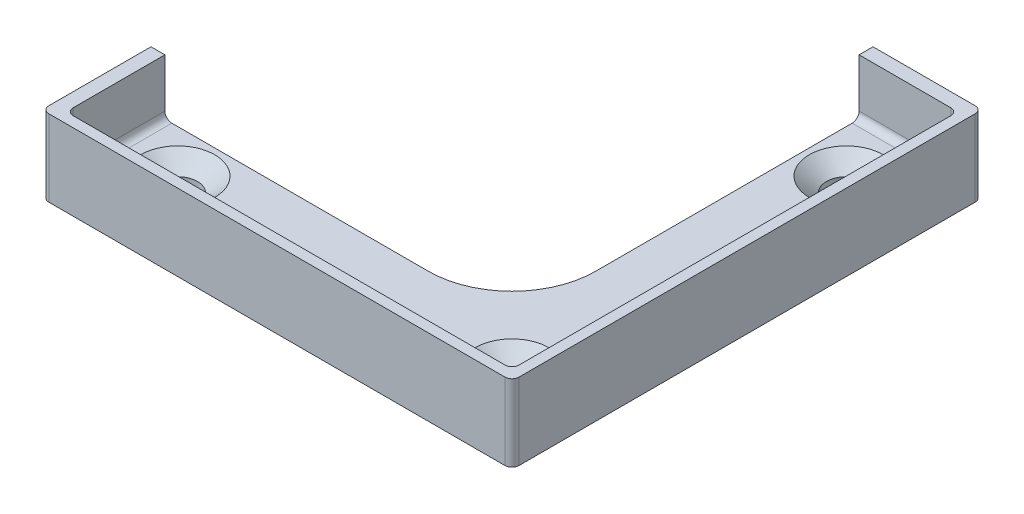
ISO-10303-21;
HEADER;
FILE_DESCRIPTION(('STEP AP214'),'2;1');
FILE_NAME('part.step','',(''),(''),'','','');
FILE_SCHEMA(('AUTOMOTIVE_DESIGN { 1 0 10303 214 1 1 1 1 }'));
ENDSEC;
DATA;
#1=APPLICATION_CONTEXT('core data for automotive mechanical design processes');
#2=APPLICATION_PROTOCOL_DEFINITION('international standard','automotive_design',2000,#1);
#3=PRODUCT_CONTEXT('',#1,'mechanical');
#4=PRODUCT('Part','Part','',(#3));
#5=PRODUCT_RELATED_PRODUCT_CATEGORY('part','',(#4));
#6=PRODUCT_DEFINITION_FORMATION('','',#4);
#7=PRODUCT_DEFINITION_CONTEXT('part definition',#1,'design');
#8=PRODUCT_DEFINITION('design','',#6,#7);
#9=PRODUCT_DEFINITION_SHAPE('','',#8);
#10=(LENGTH_UNIT() NAMED_UNIT(*) SI_UNIT(.MILLI.,.METRE.));
#11=(NAMED_UNIT(*) PLANE_ANGLE_UNIT() SI_UNIT($,.RADIAN.));
#12=(NAMED_UNIT(*) SI_UNIT($,.STERADIAN.) SOLID_ANGLE_UNIT());
#13=UNCERTAINTY_MEASURE_WITH_UNIT(LENGTH_MEASURE(1.E-05),#10,'distance_accuracy_value','');
#14=(GEOMETRIC_REPRESENTATION_CONTEXT(3) GLOBAL_UNCERTAINTY_ASSIGNED_CONTEXT((#13)) GLOBAL_UNIT_ASSIGNED_CONTEXT((#10,
#11,#12)) REPRESENTATION_CONTEXT('',''));
#15=CARTESIAN_POINT('',(0.,0.,0.));
#16=DIRECTION('',(0.,0.,1.));
#17=DIRECTION('',(1.,0.,0.));
#18=AXIS2_PLACEMENT_3D('',#15,#16,#17);
#19=CARTESIAN_POINT('',(0.,6.35,0.));
#20=DIRECTION('',(0.,1.,0.));
#21=DIRECTION('',(0.,0.,1.));
#22=AXIS2_PLACEMENT_3D('',#19,#20,#21);
#23=PLANE('',#22);
#24=DIRECTION('',(0.,0.,-1.));
#25=VECTOR('',#24,1.);
#26=CARTESIAN_POINT('',(26.590625,6.35,26.590625));
#27=LINE('',#26,#25);
#28=CARTESIAN_POINT('',(26.590625,6.35,25.796875));
#29=VERTEX_POINT('',#28);
#30=CARTESIAN_POINT('',(26.590625,6.35,-26.19375));
#31=VERTEX_POINT('',#30);
#32=EDGE_CURVE('E194',#29,#31,#27,.T.);
#33=ORIENTED_EDGE('',*,*,#32,.T.);
#34=CARTESIAN_POINT('',(25.796875,6.35,-26.19375));
#35=DIRECTION('',(0.,1.,0.));
#36=DIRECTION('',(0.,0.,1.));
#37=AXIS2_PLACEMENT_3D('',#34,#35,#36);
#38=CIRCLE('',#37,0.79375);
#39=CARTESIAN_POINT('',(25.796875,6.35,-26.9875));
#40=VERTEX_POINT('',#39);
#41=EDGE_CURVE('E257',#31,#40,#38,.T.);
#42=ORIENTED_EDGE('',*,*,#41,.T.);
#43=DIRECTION('',(-1.,0.,0.));
#44=VECTOR('',#43,1.);
#45=CARTESIAN_POINT('',(-26.9875,6.35,-26.9875));
#46=LINE('',#45,#44);
#47=CARTESIAN_POINT('',(14.1605,6.35,-26.9875));
#48=VERTEX_POINT('',#47);
#49=EDGE_CURVE('E200',#40,#48,#46,.T.);
#50=ORIENTED_EDGE('',*,*,#49,.T.);
#51=DIRECTION('',(0.,0.,-1.));
#52=VECTOR('',#51,1.);
#53=CARTESIAN_POINT('',(14.1605,6.35,14.1605));
#54=LINE('',#53,#52);
#55=CARTESIAN_POINT('',(14.1605,6.35,-25.4));
#56=VERTEX_POINT('',#55);
#57=EDGE_CURVE('E185',#56,#48,#54,.T.);
#58=ORIENTED_EDGE('',*,*,#57,.F.);
#59=DIRECTION('',(-1.,0.,0.));
#60=VECTOR('',#59,1.);
#61=CARTESIAN_POINT('',(-25.4,6.35,-25.4));
#62=LINE('',#61,#60);
#63=CARTESIAN_POINT('',(24.60625,6.35,-25.4));
#64=VERTEX_POINT('',#63);
#65=EDGE_CURVE('E366',#64,#56,#62,.T.);
#66=ORIENTED_EDGE('',*,*,#65,.F.);
#67=CARTESIAN_POINT('',(24.60625,6.35,-24.60625));
#68=DIRECTION('',(0.,1.,0.));
#69=DIRECTION('',(0.,0.,1.));
#70=AXIS2_PLACEMENT_3D('',#67,#68,#69);
#71=CIRCLE('',#70,0.79375);
#72=CARTESIAN_POINT('',(25.4,6.35,-24.60625));
#73=VERTEX_POINT('',#72);
#74=EDGE_CURVE('E294',#64,#73,#71,.F.);
#75=ORIENTED_EDGE('',*,*,#74,.T.);
#76=DIRECTION('',(0.,0.,-1.));
#77=VECTOR('',#76,1.);
#78=CARTESIAN_POINT('',(25.4,6.35,-25.4));
#79=LINE('',#78,#77);
#80=CARTESIAN_POINT('',(25.4,6.35,24.60625));
#81=VERTEX_POINT('',#80);
#82=EDGE_CURVE('E363',#81,#73,#79,.T.);
#83=ORIENTED_EDGE('',*,*,#82,.F.);
#84=CARTESIAN_POINT('',(24.60625,6.35,24.60625));
#85=DIRECTION('',(0.,1.,0.));
#86=DIRECTION('',(0.,0.,1.));
#87=AXIS2_PLACEMENT_3D('',#84,#85,#86);
#88=CIRCLE('',#87,0.79375);
#89=CARTESIAN_POINT('',(24.60625,6.35,25.4));
#90=VERTEX_POINT('',#89);
#91=EDGE_CURVE('E296',#81,#90,#88,.F.);
#92=ORIENTED_EDGE('',*,*,#91,.T.);
#93=DIRECTION('',(1.,0.,0.));
#94=VECTOR('',#93,1.);
#95=CARTESIAN_POINT('',(-25.4,6.35,25.4));
#96=LINE('',#95,#94);
#97=CARTESIAN_POINT('',(-24.60625,6.35,25.4));
#98=VERTEX_POINT('',#97);
#99=EDGE_CURVE('E205',#98,#90,#96,.T.);
#100=ORIENTED_EDGE('',*,*,#99,.F.);
#101=CARTESIAN_POINT('',(-24.60625,6.35,24.60625));
#102=DIRECTION('',(0.,1.,0.));
#103=DIRECTION('',(0.,0.,1.));
#104=AXIS2_PLACEMENT_3D('',#101,#102,#103);
#105=CIRCLE('',#104,0.79375);
#106=CARTESIAN_POINT('',(-25.4,6.35,24.60625));
#107=VERTEX_POINT('',#106);
#108=EDGE_CURVE('E11',#98,#107,#105,.F.);
#109=ORIENTED_EDGE('',*,*,#108,.T.);
#110=DIRECTION('',(0.,0.,1.));
#111=VECTOR('',#110,1.);
#112=CARTESIAN_POINT('',(-25.4,6.35,-25.4));
#113=LINE('',#112,#111);
#114=CARTESIAN_POINT('',(-25.4,6.35,14.1605));
#115=VERTEX_POINT('',#114);
#116=EDGE_CURVE('E193',#115,#107,#113,.T.);
#117=ORIENTED_EDGE('',*,*,#116,.F.);
#118=DIRECTION('',(1.,0.,0.));
#119=VECTOR('',#118,1.);
#120=CARTESIAN_POINT('',(-26.9875,6.35,14.1605));
#121=LINE('',#120,#119);
#122=CARTESIAN_POINT('',(-26.9875,6.35,14.1605));
#123=VERTEX_POINT('',#122);
#124=EDGE_CURVE('E178',#123,#115,#121,.T.);
#125=ORIENTED_EDGE('',*,*,#124,.F.);
#126=DIRECTION('',(0.,0.,1.));
#127=VECTOR('',#126,1.);
#128=CARTESIAN_POINT('',(-26.9875,6.35,-26.9875));
#129=LINE('',#128,#127);
#130=CARTESIAN_POINT('',(-26.9875,6.35,25.796875));
#131=VERTEX_POINT('',#130);
#132=EDGE_CURVE('E191',#123,#131,#129,.T.);
#133=ORIENTED_EDGE('',*,*,#132,.T.);
#134=CARTESIAN_POINT('',(-26.19375,6.35,25.796875));
#135=DIRECTION('',(0.,1.,0.));
#136=DIRECTION('',(0.,0.,1.));
#137=AXIS2_PLACEMENT_3D('',#134,#135,#136);
#138=CIRCLE('',#137,0.79375);
#139=CARTESIAN_POINT('',(-26.19375,6.35,26.590625));
#140=VERTEX_POINT('',#139);
#141=EDGE_CURVE('E253',#131,#140,#138,.T.);
#142=ORIENTED_EDGE('',*,*,#141,.T.);
#143=DIRECTION('',(1.,0.,0.));
#144=VECTOR('',#143,1.);
#145=CARTESIAN_POINT('',(-26.9875,6.35,26.590625));
#146=LINE('',#145,#144);
#147=CARTESIAN_POINT('',(25.796875,6.35,26.590625));
#148=VERTEX_POINT('',#147);
#149=EDGE_CURVE('E325',#140,#148,#146,.T.);
#150=ORIENTED_EDGE('',*,*,#149,.T.);
#151=CARTESIAN_POINT('',(25.796875,6.35,25.796875));
#152=DIRECTION('',(0.,1.,0.));
#153=DIRECTION('',(0.,0.,1.));
#154=AXIS2_PLACEMENT_3D('',#151,#152,#153);
#155=CIRCLE('',#154,0.79375);
#156=EDGE_CURVE('E255',#148,#29,#155,.T.);
#157=ORIENTED_EDGE('',*,*,#156,.T.);
#158=EDGE_LOOP('',(#33,#42,#50,#58,#66,#75,#83,#92,#100,#109,#117,#125,#133,#142,#150,#157));
#159=FACE_BOUND('',#158,.T.);
#160=ADVANCED_FACE('F33',(#159),#23,.T.);
#161=CARTESIAN_POINT('',(-26.9875,6.35,-26.9875));
#162=DIRECTION('',(0.,0.,1.));
#163=DIRECTION('',(1.,0.,0.));
#164=AXIS2_PLACEMENT_3D('',#161,#162,#163);
#165=PLANE('',#164);
#166=ORIENTED_EDGE('',*,*,#49,.F.);
#167=DIRECTION('',(0.,-1.,0.));
#168=VECTOR('',#167,1.);
#169=CARTESIAN_POINT('',(25.796875,6.35,-26.9875));
#170=LINE('',#169,#168);
#171=CARTESIAN_POINT('',(25.796875,-2.38125,-26.9875));
#172=VERTEX_POINT('',#171);
#173=EDGE_CURVE('E239',#40,#172,#170,.T.);
#174=ORIENTED_EDGE('',*,*,#173,.T.);
#175=DIRECTION('',(1.,0.,0.));
#176=VECTOR('',#175,1.);
#177=CARTESIAN_POINT('',(-26.9875,-2.38125,-26.9875));
#178=LINE('',#177,#176);
#179=CARTESIAN_POINT('',(14.1605,-2.38125,-26.9875));
#180=VERTEX_POINT('',#179);
#181=EDGE_CURVE('E214',#180,#172,#178,.T.);
#182=ORIENTED_EDGE('',*,*,#181,.F.);
#183=DIRECTION('',(0.,1.,0.));
#184=VECTOR('',#183,1.);
#185=CARTESIAN_POINT('',(14.1605,-5.63245,-26.9875));
#186=LINE('',#185,#184);
#187=EDGE_CURVE('E184',#180,#48,#186,.T.);
#188=ORIENTED_EDGE('',*,*,#187,.T.);
#189=EDGE_LOOP('',(#166,#174,#182,#188));
#190=FACE_BOUND('',#189,.T.);
#191=ADVANCED_FACE('F415',(#190),#165,.F.);
#192=CARTESIAN_POINT('',(-26.9875,6.35,-26.9875));
#193=DIRECTION('',(1.,0.,0.));
#194=DIRECTION('',(0.,0.,-1.));
#195=AXIS2_PLACEMENT_3D('',#192,#193,#194);
#196=PLANE('',#195);
#197=DIRECTION('',(0.,0.,-1.));
#198=VECTOR('',#197,1.);
#199=CARTESIAN_POINT('',(-26.9875,-2.38125,26.9875));
#200=LINE('',#199,#198);
#201=CARTESIAN_POINT('',(-26.9875,-2.38125,25.796875));
#202=VERTEX_POINT('',#201);
#203=CARTESIAN_POINT('',(-26.9875,-2.38125,14.1605));
#204=VERTEX_POINT('',#203);
#205=EDGE_CURVE('E361',#202,#204,#200,.T.);
#206=ORIENTED_EDGE('',*,*,#205,.F.);
#207=DIRECTION('',(0.,-1.,0.));
#208=VECTOR('',#207,1.);
#209=CARTESIAN_POINT('',(-26.9875,6.35,25.796875));
#210=LINE('',#209,#208);
#211=EDGE_CURVE('E198',#202,#131,#210,.F.);
#212=ORIENTED_EDGE('',*,*,#211,.T.);
#213=ORIENTED_EDGE('',*,*,#132,.F.);
#214=DIRECTION('',(0.,1.,0.));
#215=VECTOR('',#214,1.);
#216=CARTESIAN_POINT('',(-26.9875,-5.63245,14.1605));
#217=LINE('',#216,#215);
#218=EDGE_CURVE('E174',#204,#123,#217,.T.);
#219=ORIENTED_EDGE('',*,*,#218,.F.);
#220=EDGE_LOOP('',(#206,#212,#213,#219));
#221=FACE_BOUND('',#220,.T.);
#222=ADVANCED_FACE('F196',(#221),#196,.F.);
#223=CARTESIAN_POINT('',(25.4,6.35,-25.4));
#224=DIRECTION('',(-1.,0.,0.));
#225=DIRECTION('',(0.,0.,1.));
#226=AXIS2_PLACEMENT_3D('',#223,#224,#225);
#227=PLANE('',#226);
#228=ORIENTED_EDGE('',*,*,#82,.T.);
#229=DIRECTION('',(0.,-1.,0.));
#230=VECTOR('',#229,1.);
#231=CARTESIAN_POINT('',(25.4,0.,-24.60625));
#232=LINE('',#231,#230);
#233=CARTESIAN_POINT('',(25.4,0.79375,-24.60625));
#234=VERTEX_POINT('',#233);
#235=EDGE_CURVE('E282',#73,#234,#232,.T.);
#236=ORIENTED_EDGE('',*,*,#235,.T.);
#237=DIRECTION('',(0.,0.,-1.));
#238=VECTOR('',#237,1.);
#239=CARTESIAN_POINT('',(25.4,0.79375,-25.4));
#240=LINE('',#239,#238);
#241=CARTESIAN_POINT('',(25.4,0.79375,24.60625));
#242=VERTEX_POINT('',#241);
#243=EDGE_CURVE('E280',#234,#242,#240,.F.);
#244=ORIENTED_EDGE('',*,*,#243,.T.);
#245=DIRECTION('',(0.,-1.,0.));
#246=VECTOR('',#245,1.);
#247=CARTESIAN_POINT('',(25.4,6.35,24.60625));
#248=LINE('',#247,#246);
#249=EDGE_CURVE('E278',#242,#81,#248,.F.);
#250=ORIENTED_EDGE('',*,*,#249,.T.);
#251=EDGE_LOOP('',(#228,#236,#244,#250));
#252=FACE_BOUND('',#251,.T.);
#253=ADVANCED_FACE('F451',(#252),#227,.T.);
#254=CARTESIAN_POINT('',(-25.4,6.35,-25.4));
#255=DIRECTION('',(0.,0.,1.));
#256=DIRECTION('',(1.,0.,0.));
#257=AXIS2_PLACEMENT_3D('',#254,#255,#256);
#258=PLANE('',#257);
#259=DIRECTION('',(0.,1.,0.));
#260=VECTOR('',#259,1.);
#261=CARTESIAN_POINT('',(14.1605,6.35,-25.4));
#262=LINE('',#261,#260);
#263=CARTESIAN_POINT('',(14.1605,0.79375,-25.4));
#264=VERTEX_POINT('',#263);
#265=EDGE_CURVE('E344',#264,#56,#262,.T.);
#266=ORIENTED_EDGE('',*,*,#265,.F.);
#267=DIRECTION('',(-1.,0.,0.));
#268=VECTOR('',#267,1.);
#269=CARTESIAN_POINT('',(-25.4,0.79375,-25.4));
#270=LINE('',#269,#268);
#271=CARTESIAN_POINT('',(24.60625,0.79375,-25.4));
#272=VERTEX_POINT('',#271);
#273=EDGE_CURVE('E276',#264,#272,#270,.F.);
#274=ORIENTED_EDGE('',*,*,#273,.T.);
#275=DIRECTION('',(0.,-1.,0.));
#276=VECTOR('',#275,1.);
#277=CARTESIAN_POINT('',(24.60625,6.35,-25.4));
#278=LINE('',#277,#276);
#279=EDGE_CURVE('E274',#272,#64,#278,.F.);
#280=ORIENTED_EDGE('',*,*,#279,.T.);
#281=ORIENTED_EDGE('',*,*,#65,.T.);
#282=EDGE_LOOP('',(#266,#274,#280,#281));
#283=FACE_BOUND('',#282,.T.);
#284=ADVANCED_FACE('F503',(#283),#258,.T.);
#285=CARTESIAN_POINT('',(-25.4,6.35,-25.4));
#286=DIRECTION('',(1.,0.,0.));
#287=DIRECTION('',(0.,0.,-1.));
#288=AXIS2_PLACEMENT_3D('',#285,#286,#287);
#289=PLANE('',#288);
#290=DIRECTION('',(0.,-1.,0.));
#291=VECTOR('',#290,1.);
#292=CARTESIAN_POINT('',(-25.4,0.,24.60625));
#293=LINE('',#292,#291);
#294=CARTESIAN_POINT('',(-25.4,0.79375,24.60625));
#295=VERTEX_POINT('',#294);
#296=EDGE_CURVE('E50',#107,#295,#293,.T.);
#297=ORIENTED_EDGE('',*,*,#296,.T.);
#298=DIRECTION('',(0.,0.,1.));
#299=VECTOR('',#298,1.);
#300=CARTESIAN_POINT('',(-25.4,0.79375,-25.4));
#301=LINE('',#300,#299);
#302=CARTESIAN_POINT('',(-25.4,0.79375,14.1605));
#303=VERTEX_POINT('',#302);
#304=EDGE_CURVE('E54',#295,#303,#301,.F.);
#305=ORIENTED_EDGE('',*,*,#304,.T.);
#306=DIRECTION('',(0.,-1.,0.));
#307=VECTOR('',#306,1.);
#308=CARTESIAN_POINT('',(-25.4,6.35,14.1605));
#309=LINE('',#308,#307);
#310=EDGE_CURVE('E340',#115,#303,#309,.T.);
#311=ORIENTED_EDGE('',*,*,#310,.F.);
#312=ORIENTED_EDGE('',*,*,#116,.T.);
#313=EDGE_LOOP('',(#297,#305,#311,#312));
#314=FACE_BOUND('',#313,.T.);
#315=ADVANCED_FACE('F391',(#314),#289,.T.);
#316=CARTESIAN_POINT('',(-25.4,6.35,25.4));
#317=DIRECTION('',(0.,0.,-1.));
#318=DIRECTION('',(-1.,0.,0.));
#319=AXIS2_PLACEMENT_3D('',#316,#317,#318);
#320=PLANE('',#319);
#321=ORIENTED_EDGE('',*,*,#99,.T.);
#322=DIRECTION('',(0.,-1.,0.));
#323=VECTOR('',#322,1.);
#324=CARTESIAN_POINT('',(24.60625,0.,25.4));
#325=LINE('',#324,#323);
#326=CARTESIAN_POINT('',(24.60625,0.79375,25.4));
#327=VERTEX_POINT('',#326);
#328=EDGE_CURVE('E288',#90,#327,#325,.T.);
#329=ORIENTED_EDGE('',*,*,#328,.T.);
#330=DIRECTION('',(1.,0.,0.));
#331=VECTOR('',#330,1.);
#332=CARTESIAN_POINT('',(-25.4,0.79375,25.4));
#333=LINE('',#332,#331);
#334=CARTESIAN_POINT('',(-24.60625,0.79375,25.4));
#335=VERTEX_POINT('',#334);
#336=EDGE_CURVE('E284',#327,#335,#333,.F.);
#337=ORIENTED_EDGE('',*,*,#336,.T.);
#338=DIRECTION('',(0.,-1.,0.));
#339=VECTOR('',#338,1.);
#340=CARTESIAN_POINT('',(-24.60625,6.35,25.4));
#341=LINE('',#340,#339);
#342=EDGE_CURVE('E286',#335,#98,#341,.F.);
#343=ORIENTED_EDGE('',*,*,#342,.T.);
#344=EDGE_LOOP('',(#321,#329,#337,#343));
#345=FACE_BOUND('',#344,.T.);
#346=ADVANCED_FACE('F373',(#345),#320,.T.);
#347=CARTESIAN_POINT('',(0.,0.,0.));
#348=DIRECTION('',(0.,-1.,0.));
#349=DIRECTION('',(0.,0.,-1.));
#350=AXIS2_PLACEMENT_3D('',#347,#348,#349);
#351=PLANE('',#350);
#352=CARTESIAN_POINT('',(19.05,0.,19.05));
#353=DIRECTION('',(0.,1.,0.));
#354=DIRECTION('',(0.,0.,1.));
#355=AXIS2_PLACEMENT_3D('',#352,#353,#354);
#356=CIRCLE('',#355,4.2164);
#357=CARTESIAN_POINT('',(19.05,0.,23.2664));
#358=VERTEX_POINT('',#357);
#359=EDGE_CURVE('E346',#358,#358,#356,.T.);
#360=ORIENTED_EDGE('',*,*,#359,.F.);
#361=EDGE_LOOP('',(#360));
#362=FACE_BOUND('',#361,.T.);
#363=CARTESIAN_POINT('',(19.05,0.,-19.05));
#364=DIRECTION('',(0.,1.,0.));
#365=DIRECTION('',(0.,0.,1.));
#366=AXIS2_PLACEMENT_3D('',#363,#364,#365);
#367=CIRCLE('',#366,4.2164);
#368=CARTESIAN_POINT('',(19.05,0.,-14.8336));
#369=VERTEX_POINT('',#368);
#370=EDGE_CURVE('E224',#369,#369,#367,.T.);
#371=ORIENTED_EDGE('',*,*,#370,.F.);
#372=EDGE_LOOP('',(#371));
#373=FACE_BOUND('',#372,.T.);
#374=CARTESIAN_POINT('',(-19.05,0.,19.05));
#375=DIRECTION('',(0.,1.,0.));
#376=DIRECTION('',(0.,0.,1.));
#377=AXIS2_PLACEMENT_3D('',#374,#375,#376);
#378=CIRCLE('',#377,4.2164);
#379=CARTESIAN_POINT('',(-19.05,0.,23.2664));
#380=VERTEX_POINT('',#379);
#381=EDGE_CURVE('E219',#380,#380,#378,.T.);
#382=ORIENTED_EDGE('',*,*,#381,.F.);
#383=EDGE_LOOP('',(#382));
#384=FACE_BOUND('',#383,.T.);
#385=DIRECTION('',(0.,0.,-1.));
#386=VECTOR('',#385,1.);
#387=CARTESIAN_POINT('',(24.60625,0.,0.));
#388=LINE('',#387,#386);
#389=CARTESIAN_POINT('',(24.60625,0.,24.60625));
#390=VERTEX_POINT('',#389);
#391=CARTESIAN_POINT('',(24.60625,0.,-24.60625));
#392=VERTEX_POINT('',#391);
#393=EDGE_CURVE('E269',#390,#392,#388,.T.);
#394=ORIENTED_EDGE('',*,*,#393,.T.);
#395=DIRECTION('',(-1.,0.,0.));
#396=VECTOR('',#395,1.);
#397=CARTESIAN_POINT('',(0.,0.,-24.60625));
#398=LINE('',#397,#396);
#399=CARTESIAN_POINT('',(14.1605,0.,-24.60625));
#400=VERTEX_POINT('',#399);
#401=EDGE_CURVE('E271',#392,#400,#398,.T.);
#402=ORIENTED_EDGE('',*,*,#401,.T.);
#403=DIRECTION('',(0.,0.,1.));
#404=VECTOR('',#403,1.);
#405=CARTESIAN_POINT('',(14.1605,0.,0.));
#406=LINE('',#405,#404);
#407=CARTESIAN_POINT('',(14.1605,0.,4.6355));
#408=VERTEX_POINT('',#407);
#409=EDGE_CURVE('E342',#400,#408,#406,.T.);
#410=ORIENTED_EDGE('',*,*,#409,.T.);
#411=CARTESIAN_POINT('',(4.63550000000001,0.,4.6355));
#412=DIRECTION('',(0.,-1.,0.));
#413=DIRECTION('',(0.,0.,-1.));
#414=AXIS2_PLACEMENT_3D('',#411,#412,#413);
#415=CIRCLE('',#414,9.525);
#416=CARTESIAN_POINT('',(4.63550000000001,0.,14.1605));
#417=VERTEX_POINT('',#416);
#418=EDGE_CURVE('E235',#408,#417,#415,.T.);
#419=ORIENTED_EDGE('',*,*,#418,.T.);
#420=DIRECTION('',(-1.,0.,0.));
#421=VECTOR('',#420,1.);
#422=CARTESIAN_POINT('',(0.,0.,14.1605));
#423=LINE('',#422,#421);
#424=CARTESIAN_POINT('',(-24.60625,0.,14.1605));
#425=VERTEX_POINT('',#424);
#426=EDGE_CURVE('E336',#417,#425,#423,.T.);
#427=ORIENTED_EDGE('',*,*,#426,.T.);
#428=DIRECTION('',(0.,0.,1.));
#429=VECTOR('',#428,1.);
#430=CARTESIAN_POINT('',(-24.60625,0.,0.));
#431=LINE('',#430,#429);
#432=CARTESIAN_POINT('',(-24.60625,0.,24.60625));
#433=VERTEX_POINT('',#432);
#434=EDGE_CURVE('E267',#425,#433,#431,.T.);
#435=ORIENTED_EDGE('',*,*,#434,.T.);
#436=DIRECTION('',(1.,0.,0.));
#437=VECTOR('',#436,1.);
#438=CARTESIAN_POINT('',(0.,0.,24.60625));
#439=LINE('',#438,#437);
#440=EDGE_CURVE('E265',#433,#390,#439,.T.);
#441=ORIENTED_EDGE('',*,*,#440,.T.);
#442=EDGE_LOOP('',(#394,#402,#410,#419,#427,#435,#441));
#443=FACE_BOUND('',#442,.T.);
#444=ADVANCED_FACE('F397',(#362,#373,#384,#443),#351,.F.);
#445=CARTESIAN_POINT('',(0.,-2.38125,0.));
#446=DIRECTION('',(0.,-1.,0.));
#447=DIRECTION('',(0.,0.,-1.));
#448=AXIS2_PLACEMENT_3D('',#445,#446,#447);
#449=PLANE('',#448);
#450=ORIENTED_EDGE('',*,*,#181,.T.);
#451=CARTESIAN_POINT('',(25.796875,-2.38125,-26.19375));
#452=DIRECTION('',(0.,-1.,0.));
#453=DIRECTION('',(0.,0.,-1.));
#454=AXIS2_PLACEMENT_3D('',#451,#452,#453);
#455=CIRCLE('',#454,0.79375);
#456=CARTESIAN_POINT('',(26.590625,-2.38125,-26.19375));
#457=VERTEX_POINT('',#456);
#458=EDGE_CURVE('E246',#172,#457,#455,.T.);
#459=ORIENTED_EDGE('',*,*,#458,.T.);
#460=DIRECTION('',(0.,0.,-1.));
#461=VECTOR('',#460,1.);
#462=CARTESIAN_POINT('',(26.590625,-2.38125,0.));
#463=LINE('',#462,#461);
#464=CARTESIAN_POINT('',(26.590625,-2.38125,25.796875));
#465=VERTEX_POINT('',#464);
#466=EDGE_CURVE('E203',#465,#457,#463,.T.);
#467=ORIENTED_EDGE('',*,*,#466,.F.);
#468=CARTESIAN_POINT('',(25.796875,-2.38125,25.796875));
#469=DIRECTION('',(0.,-1.,0.));
#470=DIRECTION('',(0.,0.,-1.));
#471=AXIS2_PLACEMENT_3D('',#468,#469,#470);
#472=CIRCLE('',#471,0.79375);
#473=CARTESIAN_POINT('',(25.796875,-2.38125,26.590625));
#474=VERTEX_POINT('',#473);
#475=EDGE_CURVE('E244',#465,#474,#472,.T.);
#476=ORIENTED_EDGE('',*,*,#475,.T.);
#477=DIRECTION('',(1.,0.,0.));
#478=VECTOR('',#477,1.);
#479=CARTESIAN_POINT('',(0.,-2.38125,26.590625));
#480=LINE('',#479,#478);
#481=CARTESIAN_POINT('',(-26.19375,-2.38125,26.590625));
#482=VERTEX_POINT('',#481);
#483=EDGE_CURVE('E199',#482,#474,#480,.T.);
#484=ORIENTED_EDGE('',*,*,#483,.F.);
#485=CARTESIAN_POINT('',(-26.19375,-2.38125,25.796875));
#486=DIRECTION('',(0.,-1.,0.));
#487=DIRECTION('',(0.,0.,-1.));
#488=AXIS2_PLACEMENT_3D('',#485,#486,#487);
#489=CIRCLE('',#488,0.79375);
#490=EDGE_CURVE('E242',#482,#202,#489,.T.);
#491=ORIENTED_EDGE('',*,*,#490,.T.);
#492=ORIENTED_EDGE('',*,*,#205,.T.);
#493=DIRECTION('',(-1.,0.,0.));
#494=VECTOR('',#493,1.);
#495=CARTESIAN_POINT('',(0.,-2.38125,14.1605));
#496=LINE('',#495,#494);
#497=CARTESIAN_POINT('',(4.63550000000001,-2.38125,14.1605));
#498=VERTEX_POINT('',#497);
#499=EDGE_CURVE('E180',#498,#204,#496,.T.);
#500=ORIENTED_EDGE('',*,*,#499,.F.);
#501=CARTESIAN_POINT('',(4.63550000000001,-2.38125,4.6355));
#502=DIRECTION('',(0.,-1.,0.));
#503=DIRECTION('',(0.,0.,-1.));
#504=AXIS2_PLACEMENT_3D('',#501,#502,#503);
#505=CIRCLE('',#504,9.525);
#506=CARTESIAN_POINT('',(14.1605,-2.38125,4.6355));
#507=VERTEX_POINT('',#506);
#508=EDGE_CURVE('E237',#498,#507,#505,.F.);
#509=ORIENTED_EDGE('',*,*,#508,.T.);
#510=DIRECTION('',(0.,0.,1.));
#511=VECTOR('',#510,1.);
#512=CARTESIAN_POINT('',(14.1605,-2.38125,0.));
#513=LINE('',#512,#511);
#514=EDGE_CURVE('E227',#180,#507,#513,.T.);
#515=ORIENTED_EDGE('',*,*,#514,.F.);
#516=EDGE_LOOP('',(#450,#459,#467,#476,#484,#491,#492,#500,#509,#515));
#517=FACE_BOUND('',#516,.T.);
#518=CARTESIAN_POINT('',(19.05,-2.38125,19.05));
#519=DIRECTION('',(0.,-1.,0.));
#520=DIRECTION('',(0.,0.,-1.));
#521=AXIS2_PLACEMENT_3D('',#518,#519,#520);
#522=CIRCLE('',#521,2.2479);
#523=CARTESIAN_POINT('',(19.05,-2.38125,16.8021));
#524=VERTEX_POINT('',#523);
#525=EDGE_CURVE('E221',#524,#524,#522,.T.);
#526=ORIENTED_EDGE('',*,*,#525,.F.);
#527=EDGE_LOOP('',(#526));
#528=FACE_BOUND('',#527,.T.);
#529=CARTESIAN_POINT('',(19.05,-2.38125,-19.05));
#530=DIRECTION('',(0.,-1.,0.));
#531=DIRECTION('',(0.,0.,-1.));
#532=AXIS2_PLACEMENT_3D('',#529,#530,#531);
#533=CIRCLE('',#532,2.2479);
#534=CARTESIAN_POINT('',(19.05,-2.38125,-21.2979));
#535=VERTEX_POINT('',#534);
#536=EDGE_CURVE('E216',#535,#535,#533,.T.);
#537=ORIENTED_EDGE('',*,*,#536,.F.);
#538=EDGE_LOOP('',(#537));
#539=FACE_BOUND('',#538,.T.);
#540=CARTESIAN_POINT('',(-19.05,-2.38125,19.05));
#541=DIRECTION('',(0.,-1.,0.));
#542=DIRECTION('',(0.,0.,-1.));
#543=AXIS2_PLACEMENT_3D('',#540,#541,#542);
#544=CIRCLE('',#543,2.2479);
#545=CARTESIAN_POINT('',(-19.05,-2.38125,16.8021));
#546=VERTEX_POINT('',#545);
#547=EDGE_CURVE('E211',#546,#546,#544,.T.);
#548=ORIENTED_EDGE('',*,*,#547,.F.);
#549=EDGE_LOOP('',(#548));
#550=FACE_BOUND('',#549,.T.);
#551=ADVANCED_FACE('F406',(#517,#528,#539,#550),#449,.T.);
#552=CARTESIAN_POINT('',(-19.05,0.,19.05));
#553=DIRECTION('',(0.,1.,0.));
#554=DIRECTION('',(0.,0.,1.));
#555=AXIS2_PLACEMENT_3D('',#552,#553,#554);
#556=CYLINDRICAL_SURFACE('',#555,2.2479);
#557=ORIENTED_EDGE('',*,*,#547,.T.);
#558=EDGE_LOOP('',(#557));
#559=FACE_BOUND('',#558,.T.);
#560=CARTESIAN_POINT('',(-19.05,-1.65176762397248,19.05));
#561=DIRECTION('',(0.,1.,0.));
#562=DIRECTION('',(0.,0.,1.));
#563=AXIS2_PLACEMENT_3D('',#560,#561,#562);
#564=CIRCLE('',#563,2.2479);
#565=CARTESIAN_POINT('',(-19.05,-1.65176762397248,21.2979));
#566=VERTEX_POINT('',#565);
#567=EDGE_CURVE('E215',#566,#566,#564,.T.);
#568=ORIENTED_EDGE('',*,*,#567,.T.);
#569=EDGE_LOOP('',(#568));
#570=FACE_BOUND('',#569,.T.);
#571=ADVANCED_FACE('F490',(#559,#570),#556,.F.);
#572=CARTESIAN_POINT('',(-19.05,0.,19.05));
#573=DIRECTION('',(0.,1.,0.));
#574=DIRECTION('',(0.,0.,1.));
#575=AXIS2_PLACEMENT_3D('',#572,#573,#574);
#576=CONICAL_SURFACE('',#575,4.2164,0.872664625997165);
#577=ORIENTED_EDGE('',*,*,#567,.F.);
#578=EDGE_LOOP('',(#577));
#579=FACE_BOUND('',#578,.T.);
#580=ORIENTED_EDGE('',*,*,#381,.T.);
#581=EDGE_LOOP('',(#580));
#582=FACE_BOUND('',#581,.T.);
#583=ADVANCED_FACE('F486',(#579,#582),#576,.F.);
#584=CARTESIAN_POINT('',(19.05,0.,-19.05));
#585=DIRECTION('',(0.,1.,0.));
#586=DIRECTION('',(0.,0.,1.));
#587=AXIS2_PLACEMENT_3D('',#584,#585,#586);
#588=CYLINDRICAL_SURFACE('',#587,2.2479);
#589=ORIENTED_EDGE('',*,*,#536,.T.);
#590=EDGE_LOOP('',(#589));
#591=FACE_BOUND('',#590,.T.);
#592=CARTESIAN_POINT('',(19.05,-1.65176762397248,-19.05));
#593=DIRECTION('',(0.,1.,0.));
#594=DIRECTION('',(0.,0.,1.));
#595=AXIS2_PLACEMENT_3D('',#592,#593,#594);
#596=CIRCLE('',#595,2.2479);
#597=CARTESIAN_POINT('',(19.05,-1.65176762397248,-16.8021));
#598=VERTEX_POINT('',#597);
#599=EDGE_CURVE('E220',#598,#598,#596,.T.);
#600=ORIENTED_EDGE('',*,*,#599,.T.);
#601=EDGE_LOOP('',(#600));
#602=FACE_BOUND('',#601,.T.);
#603=ADVANCED_FACE('F482',(#591,#602),#588,.F.);
#604=CARTESIAN_POINT('',(19.05,0.,-19.05));
#605=DIRECTION('',(0.,1.,0.));
#606=DIRECTION('',(0.,0.,1.));
#607=AXIS2_PLACEMENT_3D('',#604,#605,#606);
#608=CONICAL_SURFACE('',#607,4.2164,0.872664625997165);
#609=ORIENTED_EDGE('',*,*,#599,.F.);
#610=EDGE_LOOP('',(#609));
#611=FACE_BOUND('',#610,.T.);
#612=ORIENTED_EDGE('',*,*,#370,.T.);
#613=EDGE_LOOP('',(#612));
#614=FACE_BOUND('',#613,.T.);
#615=ADVANCED_FACE('F478',(#611,#614),#608,.F.);
#616=CARTESIAN_POINT('',(19.05,0.,19.05));
#617=DIRECTION('',(0.,1.,0.));
#618=DIRECTION('',(0.,0.,1.));
#619=AXIS2_PLACEMENT_3D('',#616,#617,#618);
#620=CYLINDRICAL_SURFACE('',#619,2.2479);
#621=ORIENTED_EDGE('',*,*,#525,.T.);
#622=EDGE_LOOP('',(#621));
#623=FACE_BOUND('',#622,.T.);
#624=CARTESIAN_POINT('',(19.05,-1.65176762397248,19.05));
#625=DIRECTION('',(0.,1.,0.));
#626=DIRECTION('',(0.,0.,1.));
#627=AXIS2_PLACEMENT_3D('',#624,#625,#626);
#628=CIRCLE('',#627,2.2479);
#629=CARTESIAN_POINT('',(19.05,-1.65176762397248,21.2979));
#630=VERTEX_POINT('',#629);
#631=EDGE_CURVE('E225',#630,#630,#628,.T.);
#632=ORIENTED_EDGE('',*,*,#631,.T.);
#633=EDGE_LOOP('',(#632));
#634=FACE_BOUND('',#633,.T.);
#635=ADVANCED_FACE('F474',(#623,#634),#620,.F.);
#636=CARTESIAN_POINT('',(19.05,0.,19.05));
#637=DIRECTION('',(0.,1.,0.));
#638=DIRECTION('',(0.,0.,1.));
#639=AXIS2_PLACEMENT_3D('',#636,#637,#638);
#640=CONICAL_SURFACE('',#639,4.2164,0.872664625997165);
#641=ORIENTED_EDGE('',*,*,#631,.F.);
#642=EDGE_LOOP('',(#641));
#643=FACE_BOUND('',#642,.T.);
#644=ORIENTED_EDGE('',*,*,#359,.T.);
#645=EDGE_LOOP('',(#644));
#646=FACE_BOUND('',#645,.T.);
#647=ADVANCED_FACE('F469',(#643,#646),#640,.F.);
#648=CARTESIAN_POINT('',(14.1605,-5.63245,14.1605));
#649=DIRECTION('',(1.,0.,0.));
#650=DIRECTION('',(0.,0.,-1.));
#651=AXIS2_PLACEMENT_3D('',#648,#649,#650);
#652=PLANE('',#651);
#653=ORIENTED_EDGE('',*,*,#514,.T.);
#654=DIRECTION('',(0.,1.,0.));
#655=VECTOR('',#654,1.);
#656=CARTESIAN_POINT('',(14.1605,0.,4.6355));
#657=LINE('',#656,#655);
#658=EDGE_CURVE('E230',#507,#408,#657,.T.);
#659=ORIENTED_EDGE('',*,*,#658,.T.);
#660=ORIENTED_EDGE('',*,*,#409,.F.);
#661=CARTESIAN_POINT('',(14.1605,0.79375,-24.60625));
#662=DIRECTION('',(1.,0.,0.));
#663=DIRECTION('',(0.,0.,-1.));
#664=AXIS2_PLACEMENT_3D('',#661,#662,#663);
#665=CIRCLE('',#664,0.79375);
#666=EDGE_CURVE('E292',#400,#264,#665,.T.);
#667=ORIENTED_EDGE('',*,*,#666,.T.);
#668=ORIENTED_EDGE('',*,*,#265,.T.);
#669=ORIENTED_EDGE('',*,*,#57,.T.);
#670=ORIENTED_EDGE('',*,*,#187,.F.);
#671=EDGE_LOOP('',(#653,#659,#660,#667,#668,#669,#670));
#672=FACE_BOUND('',#671,.T.);
#673=ADVANCED_FACE('F410',(#672),#652,.F.);
#674=CARTESIAN_POINT('',(-26.9875,-5.63245,14.1605));
#675=DIRECTION('',(0.,0.,1.));
#676=DIRECTION('',(1.,0.,0.));
#677=AXIS2_PLACEMENT_3D('',#674,#675,#676);
#678=PLANE('',#677);
#679=ORIENTED_EDGE('',*,*,#426,.F.);
#680=DIRECTION('',(0.,1.,0.));
#681=VECTOR('',#680,1.);
#682=CARTESIAN_POINT('',(4.63550000000001,-2.38125,14.1605));
#683=LINE('',#682,#681);
#684=EDGE_CURVE('E233',#417,#498,#683,.F.);
#685=ORIENTED_EDGE('',*,*,#684,.T.);
#686=ORIENTED_EDGE('',*,*,#499,.T.);
#687=ORIENTED_EDGE('',*,*,#218,.T.);
#688=ORIENTED_EDGE('',*,*,#124,.T.);
#689=ORIENTED_EDGE('',*,*,#310,.T.);
#690=CARTESIAN_POINT('',(-24.60625,0.79375,14.1605));
#691=DIRECTION('',(0.,0.,1.));
#692=DIRECTION('',(1.,0.,0.));
#693=AXIS2_PLACEMENT_3D('',#690,#691,#692);
#694=CIRCLE('',#693,0.79375);
#695=EDGE_CURVE('E42',#303,#425,#694,.T.);
#696=ORIENTED_EDGE('',*,*,#695,.T.);
#697=EDGE_LOOP('',(#679,#685,#686,#687,#688,#689,#696));
#698=FACE_BOUND('',#697,.T.);
#699=ADVANCED_FACE('F177',(#698),#678,.F.);
#700=CARTESIAN_POINT('',(4.63550000000001,-5.63245,4.6355));
#701=DIRECTION('',(0.,-1.,0.));
#702=DIRECTION('',(0.,0.,-1.));
#703=AXIS2_PLACEMENT_3D('',#700,#701,#702);
#704=CYLINDRICAL_SURFACE('',#703,9.525);
#705=ORIENTED_EDGE('',*,*,#508,.F.);
#706=ORIENTED_EDGE('',*,*,#684,.F.);
#707=ORIENTED_EDGE('',*,*,#418,.F.);
#708=ORIENTED_EDGE('',*,*,#658,.F.);
#709=EDGE_LOOP('',(#705,#706,#707,#708));
#710=FACE_BOUND('',#709,.T.);
#711=ADVANCED_FACE('F402',(#710),#704,.F.);
#712=CARTESIAN_POINT('',(26.590625,6.35,26.590625));
#713=DIRECTION('',(-1.,0.,0.));
#714=DIRECTION('',(0.,0.,1.));
#715=AXIS2_PLACEMENT_3D('',#712,#713,#714);
#716=PLANE('',#715);
#717=ORIENTED_EDGE('',*,*,#466,.T.);
#718=DIRECTION('',(0.,-1.,0.));
#719=VECTOR('',#718,1.);
#720=CARTESIAN_POINT('',(26.590625,6.35,-26.19375));
#721=LINE('',#720,#719);
#722=EDGE_CURVE('E251',#457,#31,#721,.F.);
#723=ORIENTED_EDGE('',*,*,#722,.T.);
#724=ORIENTED_EDGE('',*,*,#32,.F.);
#725=DIRECTION('',(0.,-1.,0.));
#726=VECTOR('',#725,1.);
#727=CARTESIAN_POINT('',(26.590625,6.35,25.796875));
#728=LINE('',#727,#726);
#729=EDGE_CURVE('E248',#29,#465,#728,.T.);
#730=ORIENTED_EDGE('',*,*,#729,.T.);
#731=EDGE_LOOP('',(#717,#723,#724,#730));
#732=FACE_BOUND('',#731,.T.);
#733=ADVANCED_FACE('F421',(#732),#716,.F.);
#734=CARTESIAN_POINT('',(-26.9875,6.35,26.590625));
#735=DIRECTION('',(0.,0.,-1.));
#736=DIRECTION('',(-1.,0.,0.));
#737=AXIS2_PLACEMENT_3D('',#734,#735,#736);
#738=PLANE('',#737);
#739=ORIENTED_EDGE('',*,*,#483,.T.);
#740=DIRECTION('',(0.,-1.,0.));
#741=VECTOR('',#740,1.);
#742=CARTESIAN_POINT('',(25.796875,6.35,26.590625));
#743=LINE('',#742,#741);
#744=EDGE_CURVE('E262',#474,#148,#743,.F.);
#745=ORIENTED_EDGE('',*,*,#744,.T.);
#746=ORIENTED_EDGE('',*,*,#149,.F.);
#747=DIRECTION('',(0.,-1.,0.));
#748=VECTOR('',#747,1.);
#749=CARTESIAN_POINT('',(-26.19375,6.35,26.590625));
#750=LINE('',#749,#748);
#751=EDGE_CURVE('E259',#140,#482,#750,.T.);
#752=ORIENTED_EDGE('',*,*,#751,.T.);
#753=EDGE_LOOP('',(#739,#745,#746,#752));
#754=FACE_BOUND('',#753,.T.);
#755=ADVANCED_FACE('F431',(#754),#738,.F.);
#756=CARTESIAN_POINT('',(25.796875,6.35,-26.19375));
#757=DIRECTION('',(0.,-1.,0.));
#758=DIRECTION('',(0.,0.,-1.));
#759=AXIS2_PLACEMENT_3D('',#756,#757,#758);
#760=CYLINDRICAL_SURFACE('',#759,0.79375);
#761=ORIENTED_EDGE('',*,*,#41,.F.);
#762=ORIENTED_EDGE('',*,*,#722,.F.);
#763=ORIENTED_EDGE('',*,*,#458,.F.);
#764=ORIENTED_EDGE('',*,*,#173,.F.);
#765=EDGE_LOOP('',(#761,#762,#763,#764));
#766=FACE_BOUND('',#765,.T.);
#767=ADVANCED_FACE('F425',(#766),#760,.T.);
#768=CARTESIAN_POINT('',(25.796875,6.35,25.796875));
#769=DIRECTION('',(0.,-1.,0.));
#770=DIRECTION('',(0.,0.,-1.));
#771=AXIS2_PLACEMENT_3D('',#768,#769,#770);
#772=CYLINDRICAL_SURFACE('',#771,0.79375);
#773=ORIENTED_EDGE('',*,*,#156,.F.);
#774=ORIENTED_EDGE('',*,*,#744,.F.);
#775=ORIENTED_EDGE('',*,*,#475,.F.);
#776=ORIENTED_EDGE('',*,*,#729,.F.);
#777=EDGE_LOOP('',(#773,#774,#775,#776));
#778=FACE_BOUND('',#777,.T.);
#779=ADVANCED_FACE('F427',(#778),#772,.T.);
#780=CARTESIAN_POINT('',(-26.19375,6.35,25.796875));
#781=DIRECTION('',(0.,-1.,0.));
#782=DIRECTION('',(0.,0.,-1.));
#783=AXIS2_PLACEMENT_3D('',#780,#781,#782);
#784=CYLINDRICAL_SURFACE('',#783,0.79375);
#785=ORIENTED_EDGE('',*,*,#141,.F.);
#786=ORIENTED_EDGE('',*,*,#211,.F.);
#787=ORIENTED_EDGE('',*,*,#490,.F.);
#788=ORIENTED_EDGE('',*,*,#751,.F.);
#789=EDGE_LOOP('',(#785,#786,#787,#788));
#790=FACE_BOUND('',#789,.T.);
#791=ADVANCED_FACE('F434',(#790),#784,.T.);
#792=CARTESIAN_POINT('',(-24.60625,6.35,24.60625));
#793=DIRECTION('',(0.,1.,0.));
#794=DIRECTION('',(0.,0.,1.));
#795=AXIS2_PLACEMENT_3D('',#792,#793,#794);
#796=CYLINDRICAL_SURFACE('',#795,0.79375);
#797=ORIENTED_EDGE('',*,*,#108,.F.);
#798=ORIENTED_EDGE('',*,*,#342,.F.);
#799=CARTESIAN_POINT('',(-24.60625,0.79375,24.60625));
#800=DIRECTION('',(0.,1.,0.));
#801=DIRECTION('',(0.,0.,1.));
#802=AXIS2_PLACEMENT_3D('',#799,#800,#801);
#803=CIRCLE('',#802,0.79375);
#804=EDGE_CURVE('E37',#295,#335,#803,.T.);
#805=ORIENTED_EDGE('',*,*,#804,.F.);
#806=ORIENTED_EDGE('',*,*,#296,.F.);
#807=EDGE_LOOP('',(#797,#798,#805,#806));
#808=FACE_BOUND('',#807,.T.);
#809=ADVANCED_FACE('F35',(#808),#796,.F.);
#810=CARTESIAN_POINT('',(-24.60625,0.79375,0.));
#811=DIRECTION('',(0.,0.,1.));
#812=DIRECTION('',(1.,0.,0.));
#813=AXIS2_PLACEMENT_3D('',#810,#811,#812);
#814=CYLINDRICAL_SURFACE('',#813,0.79375);
#815=ORIENTED_EDGE('',*,*,#695,.F.);
#816=ORIENTED_EDGE('',*,*,#304,.F.);
#817=CARTESIAN_POINT('',(-24.60625,0.79375,24.60625));
#818=DIRECTION('',(0.,0.,-1.));
#819=DIRECTION('',(-1.,0.,0.));
#820=AXIS2_PLACEMENT_3D('',#817,#818,#819);
#821=CIRCLE('',#820,0.79375);
#822=EDGE_CURVE('E319',#433,#295,#821,.T.);
#823=ORIENTED_EDGE('',*,*,#822,.F.);
#824=ORIENTED_EDGE('',*,*,#434,.F.);
#825=EDGE_LOOP('',(#815,#816,#823,#824));
#826=FACE_BOUND('',#825,.T.);
#827=ADVANCED_FACE('F395',(#826),#814,.F.);
#828=CARTESIAN_POINT('',(-24.60625,0.79375,24.60625));
#829=DIRECTION('',(0.,0.,1.));
#830=DIRECTION('',(1.,0.,0.));
#831=AXIS2_PLACEMENT_3D('',#828,#829,#830);
#832=SPHERICAL_SURFACE('',#831,0.79375);
#833=ORIENTED_EDGE('',*,*,#822,.T.);
#834=ORIENTED_EDGE('',*,*,#804,.T.);
#835=CARTESIAN_POINT('',(-24.60625,0.79375,24.60625));
#836=DIRECTION('',(1.,0.,0.));
#837=DIRECTION('',(0.,0.,-1.));
#838=AXIS2_PLACEMENT_3D('',#835,#836,#837);
#839=CIRCLE('',#838,0.79375);
#840=EDGE_CURVE('E317',#433,#335,#839,.F.);
#841=ORIENTED_EDGE('',*,*,#840,.F.);
#842=EDGE_LOOP('',(#833,#834,#841));
#843=FACE_BOUND('',#842,.T.);
#844=ADVANCED_FACE('F545',(#843),#832,.F.);
#845=CARTESIAN_POINT('',(24.60625,6.35,24.60625));
#846=DIRECTION('',(0.,1.,0.));
#847=DIRECTION('',(0.,0.,1.));
#848=AXIS2_PLACEMENT_3D('',#845,#846,#847);
#849=CYLINDRICAL_SURFACE('',#848,0.79375);
#850=ORIENTED_EDGE('',*,*,#91,.F.);
#851=ORIENTED_EDGE('',*,*,#249,.F.);
#852=CARTESIAN_POINT('',(24.60625,0.79375,24.60625));
#853=DIRECTION('',(0.,1.,0.));
#854=DIRECTION('',(0.,0.,1.));
#855=AXIS2_PLACEMENT_3D('',#852,#853,#854);
#856=CIRCLE('',#855,0.79375);
#857=EDGE_CURVE('E314',#327,#242,#856,.T.);
#858=ORIENTED_EDGE('',*,*,#857,.F.);
#859=ORIENTED_EDGE('',*,*,#328,.F.);
#860=EDGE_LOOP('',(#850,#851,#858,#859));
#861=FACE_BOUND('',#860,.T.);
#862=ADVANCED_FACE('F380',(#861),#849,.F.);
#863=CARTESIAN_POINT('',(0.,0.79375,24.60625));
#864=DIRECTION('',(1.,0.,0.));
#865=DIRECTION('',(0.,0.,-1.));
#866=AXIS2_PLACEMENT_3D('',#863,#864,#865);
#867=CYLINDRICAL_SURFACE('',#866,0.79375);
#868=ORIENTED_EDGE('',*,*,#840,.T.);
#869=ORIENTED_EDGE('',*,*,#336,.F.);
#870=CARTESIAN_POINT('',(24.60625,0.79375,24.60625));
#871=DIRECTION('',(-1.,0.,0.));
#872=DIRECTION('',(0.,0.,1.));
#873=AXIS2_PLACEMENT_3D('',#870,#871,#872);
#874=CIRCLE('',#873,0.79375);
#875=EDGE_CURVE('E311',#390,#327,#874,.T.);
#876=ORIENTED_EDGE('',*,*,#875,.F.);
#877=ORIENTED_EDGE('',*,*,#440,.F.);
#878=EDGE_LOOP('',(#868,#869,#876,#877));
#879=FACE_BOUND('',#878,.T.);
#880=ADVANCED_FACE('F389',(#879),#867,.F.);
#881=CARTESIAN_POINT('',(24.60625,0.79375,24.60625));
#882=DIRECTION('',(0.,0.,1.));
#883=DIRECTION('',(1.,0.,0.));
#884=AXIS2_PLACEMENT_3D('',#881,#882,#883);
#885=SPHERICAL_SURFACE('',#884,0.79375);
#886=ORIENTED_EDGE('',*,*,#875,.T.);
#887=ORIENTED_EDGE('',*,*,#857,.T.);
#888=CARTESIAN_POINT('',(24.60625,0.79375,24.60625));
#889=DIRECTION('',(0.,0.,-1.));
#890=DIRECTION('',(-1.,0.,0.));
#891=AXIS2_PLACEMENT_3D('',#888,#889,#890);
#892=CIRCLE('',#891,0.79375);
#893=EDGE_CURVE('E308',#390,#242,#892,.F.);
#894=ORIENTED_EDGE('',*,*,#893,.F.);
#895=EDGE_LOOP('',(#886,#887,#894));
#896=FACE_BOUND('',#895,.T.);
#897=ADVANCED_FACE('F385',(#896),#885,.F.);
#898=CARTESIAN_POINT('',(24.60625,6.35,-24.60625));
#899=DIRECTION('',(0.,1.,0.));
#900=DIRECTION('',(0.,0.,1.));
#901=AXIS2_PLACEMENT_3D('',#898,#899,#900);
#902=CYLINDRICAL_SURFACE('',#901,0.79375);
#903=ORIENTED_EDGE('',*,*,#74,.F.);
#904=ORIENTED_EDGE('',*,*,#279,.F.);
#905=CARTESIAN_POINT('',(24.60625,0.79375,-24.60625));
#906=DIRECTION('',(0.,1.,0.));
#907=DIRECTION('',(0.,0.,1.));
#908=AXIS2_PLACEMENT_3D('',#905,#906,#907);
#909=CIRCLE('',#908,0.79375);
#910=EDGE_CURVE('E305',#234,#272,#909,.T.);
#911=ORIENTED_EDGE('',*,*,#910,.F.);
#912=ORIENTED_EDGE('',*,*,#235,.F.);
#913=EDGE_LOOP('',(#903,#904,#911,#912));
#914=FACE_BOUND('',#913,.T.);
#915=ADVANCED_FACE('F525',(#914),#902,.F.);
#916=CARTESIAN_POINT('',(24.60625,0.79375,0.));
#917=DIRECTION('',(0.,0.,-1.));
#918=DIRECTION('',(-1.,0.,0.));
#919=AXIS2_PLACEMENT_3D('',#916,#917,#918);
#920=CYLINDRICAL_SURFACE('',#919,0.79375);
#921=ORIENTED_EDGE('',*,*,#893,.T.);
#922=ORIENTED_EDGE('',*,*,#243,.F.);
#923=CARTESIAN_POINT('',(24.60625,0.79375,-24.60625));
#924=DIRECTION('',(0.,0.,1.));
#925=DIRECTION('',(1.,0.,0.));
#926=AXIS2_PLACEMENT_3D('',#923,#924,#925);
#927=CIRCLE('',#926,0.79375);
#928=EDGE_CURVE('E302',#392,#234,#927,.T.);
#929=ORIENTED_EDGE('',*,*,#928,.F.);
#930=ORIENTED_EDGE('',*,*,#393,.F.);
#931=EDGE_LOOP('',(#921,#922,#929,#930));
#932=FACE_BOUND('',#931,.T.);
#933=ADVANCED_FACE('F529',(#932),#920,.F.);
#934=CARTESIAN_POINT('',(24.60625,0.79375,-24.60625));
#935=DIRECTION('',(0.,0.,1.));
#936=DIRECTION('',(1.,0.,0.));
#937=AXIS2_PLACEMENT_3D('',#934,#935,#936);
#938=SPHERICAL_SURFACE('',#937,0.79375);
#939=ORIENTED_EDGE('',*,*,#928,.T.);
#940=ORIENTED_EDGE('',*,*,#910,.T.);
#941=CARTESIAN_POINT('',(24.60625,0.79375,-24.60625));
#942=DIRECTION('',(-1.,0.,0.));
#943=DIRECTION('',(0.,0.,1.));
#944=AXIS2_PLACEMENT_3D('',#941,#942,#943);
#945=CIRCLE('',#944,0.79375);
#946=EDGE_CURVE('E299',#392,#272,#945,.F.);
#947=ORIENTED_EDGE('',*,*,#946,.F.);
#948=EDGE_LOOP('',(#939,#940,#947));
#949=FACE_BOUND('',#948,.T.);
#950=ADVANCED_FACE('F519',(#949),#938,.F.);
#951=CARTESIAN_POINT('',(0.,0.79375,-24.60625));
#952=DIRECTION('',(-1.,0.,0.));
#953=DIRECTION('',(0.,0.,1.));
#954=AXIS2_PLACEMENT_3D('',#951,#952,#953);
#955=CYLINDRICAL_SURFACE('',#954,0.79375);
#956=ORIENTED_EDGE('',*,*,#946,.T.);
#957=ORIENTED_EDGE('',*,*,#273,.F.);
#958=ORIENTED_EDGE('',*,*,#666,.F.);
#959=ORIENTED_EDGE('',*,*,#401,.F.);
#960=EDGE_LOOP('',(#956,#957,#958,#959));
#961=FACE_BOUND('',#960,.T.);
#962=ADVANCED_FACE('F515',(#961),#955,.F.);
#963=CLOSED_SHELL('',(#160,#191,#222,#253,#284,#315,#346,#444,#551,#571,#583,#603,#615,#635,
#647,#673,#699,#711,#733,#755,#767,#779,#791,#809,#827,#844,#862,#880,#897,#915,#933,#950,#962));
#964=MANIFOLD_SOLID_BREP('B2',#963);
#965=ADVANCED_BREP_SHAPE_REPRESENTATION('',(#18,#964),#14);
#966=SHAPE_DEFINITION_REPRESENTATION(#9,#965);
ENDSEC;
END-ISO-10303-21;
